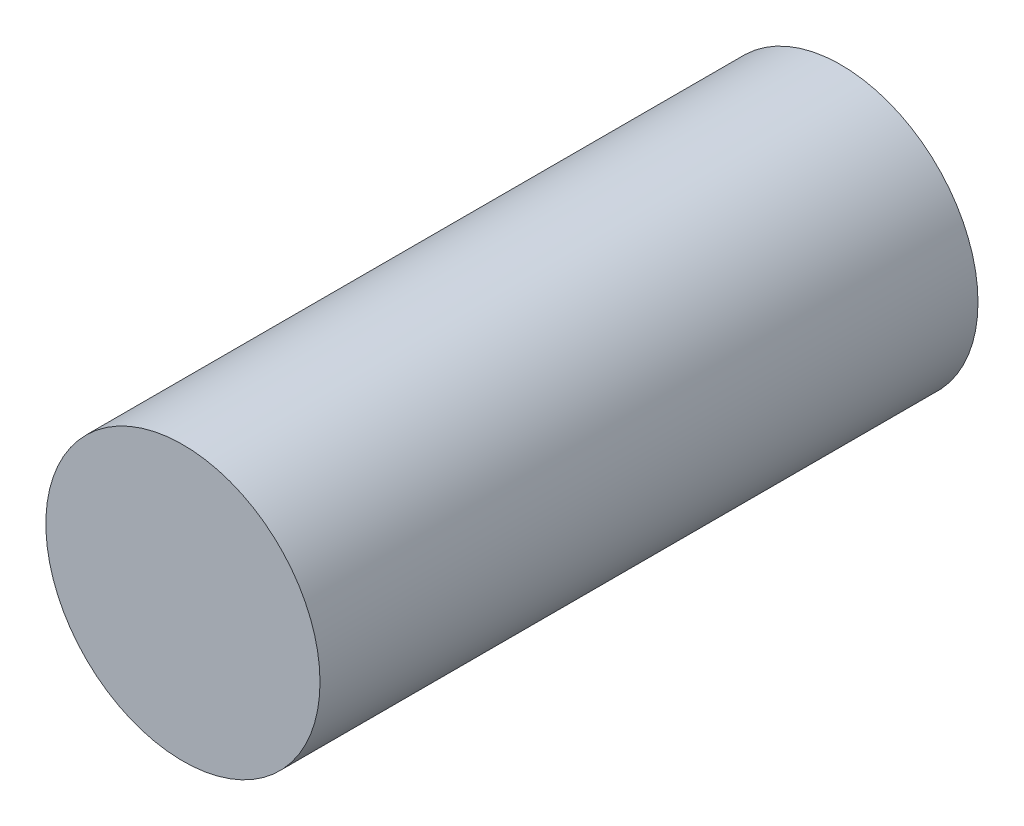
ISO-10303-21;
HEADER;
FILE_DESCRIPTION(('STEP AP214'),'2;1');
FILE_NAME('part.step','',(''),(''),'','','');
FILE_SCHEMA(('AUTOMOTIVE_DESIGN { 1 0 10303 214 1 1 1 1 }'));
ENDSEC;
DATA;
#1=APPLICATION_CONTEXT('core data for automotive mechanical design processes');
#2=APPLICATION_PROTOCOL_DEFINITION('international standard','automotive_design',2000,#1);
#3=PRODUCT_CONTEXT('',#1,'mechanical');
#4=PRODUCT('Part','Part','',(#3));
#5=PRODUCT_RELATED_PRODUCT_CATEGORY('part','',(#4));
#6=PRODUCT_DEFINITION_FORMATION('','',#4);
#7=PRODUCT_DEFINITION_CONTEXT('part definition',#1,'design');
#8=PRODUCT_DEFINITION('design','',#6,#7);
#9=PRODUCT_DEFINITION_SHAPE('','',#8);
#10=(LENGTH_UNIT() NAMED_UNIT(*) SI_UNIT(.MILLI.,.METRE.));
#11=(NAMED_UNIT(*) PLANE_ANGLE_UNIT() SI_UNIT($,.RADIAN.));
#12=(NAMED_UNIT(*) SI_UNIT($,.STERADIAN.) SOLID_ANGLE_UNIT());
#13=UNCERTAINTY_MEASURE_WITH_UNIT(LENGTH_MEASURE(1.E-05),#10,'distance_accuracy_value','');
#14=(GEOMETRIC_REPRESENTATION_CONTEXT(3) GLOBAL_UNCERTAINTY_ASSIGNED_CONTEXT((#13)) GLOBAL_UNIT_ASSIGNED_CONTEXT((#10,
#11,#12)) REPRESENTATION_CONTEXT('',''));
#15=CARTESIAN_POINT('',(0.,0.,0.));
#16=DIRECTION('',(0.,0.,1.));
#17=DIRECTION('',(1.,0.,0.));
#18=AXIS2_PLACEMENT_3D('',#15,#16,#17);
#19=CARTESIAN_POINT('',(0.,0.,6.));
#20=DIRECTION('',(0.,0.,-1.));
#21=DIRECTION('',(-1.,0.,0.));
#22=AXIS2_PLACEMENT_3D('',#19,#20,#21);
#23=CYLINDRICAL_SURFACE('',#22,1.25);
#24=CARTESIAN_POINT('',(0.,0.,6.));
#25=DIRECTION('',(0.,0.,1.));
#26=DIRECTION('',(1.,0.,0.));
#27=AXIS2_PLACEMENT_3D('',#24,#25,#26);
#28=CIRCLE('',#27,1.25);
#29=CARTESIAN_POINT('',(1.25,0.,6.));
#30=VERTEX_POINT('',#29);
#31=EDGE_CURVE('E10',#30,#30,#28,.T.);
#32=ORIENTED_EDGE('',*,*,#31,.F.);
#33=EDGE_LOOP('',(#32));
#34=FACE_BOUND('',#33,.T.);
#35=CARTESIAN_POINT('',(0.,0.,0.));
#36=DIRECTION('',(0.,0.,1.));
#37=DIRECTION('',(1.,0.,0.));
#38=AXIS2_PLACEMENT_3D('',#35,#36,#37);
#39=CIRCLE('',#38,1.25);
#40=CARTESIAN_POINT('',(1.25,0.,0.));
#41=VERTEX_POINT('',#40);
#42=EDGE_CURVE('E34',#41,#41,#39,.T.);
#43=ORIENTED_EDGE('',*,*,#42,.T.);
#44=EDGE_LOOP('',(#43));
#45=FACE_BOUND('',#44,.T.);
#46=ADVANCED_FACE('F31',(#34,#45),#23,.T.);
#47=CARTESIAN_POINT('',(0.,0.,6.));
#48=DIRECTION('',(0.,0.,1.));
#49=DIRECTION('',(1.,0.,0.));
#50=AXIS2_PLACEMENT_3D('',#47,#48,#49);
#51=PLANE('',#50);
#52=ORIENTED_EDGE('',*,*,#31,.T.);
#53=EDGE_LOOP('',(#52));
#54=FACE_BOUND('',#53,.T.);
#55=ADVANCED_FACE('F46',(#54),#51,.T.);
#56=CARTESIAN_POINT('',(0.,0.,0.));
#57=DIRECTION('',(0.,0.,1.));
#58=DIRECTION('',(1.,0.,0.));
#59=AXIS2_PLACEMENT_3D('',#56,#57,#58);
#60=PLANE('',#59);
#61=ORIENTED_EDGE('',*,*,#42,.F.);
#62=EDGE_LOOP('',(#61));
#63=FACE_BOUND('',#62,.T.);
#64=ADVANCED_FACE('F44',(#63),#60,.F.);
#65=CLOSED_SHELL('',(#46,#55,#64));
#66=MANIFOLD_SOLID_BREP('B2',#65);
#67=ADVANCED_BREP_SHAPE_REPRESENTATION('',(#18,#66),#14);
#68=SHAPE_DEFINITION_REPRESENTATION(#9,#67);
ENDSEC;
END-ISO-10303-21;
